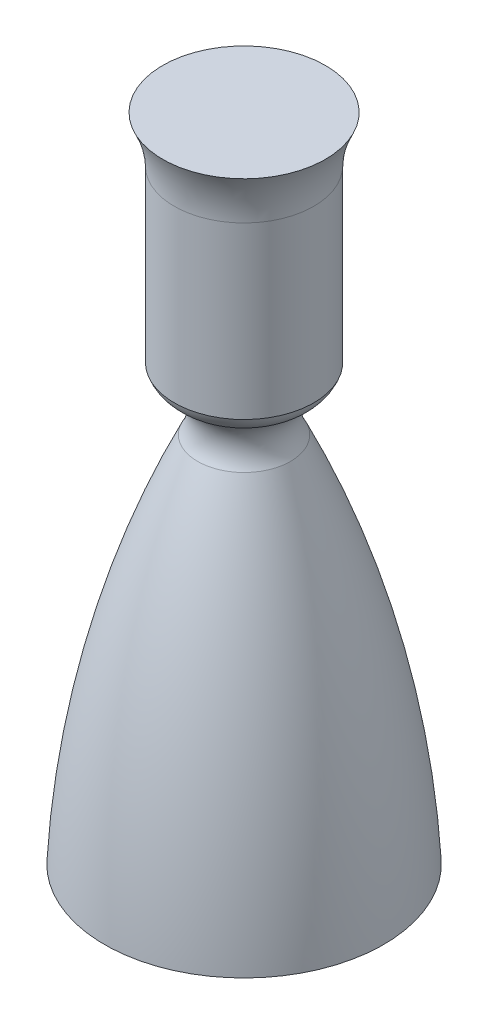
ISO-10303-21;
HEADER;
FILE_DESCRIPTION(('STEP AP214'),'2;1');
FILE_NAME('part.step','',(''),(''),'','','');
FILE_SCHEMA(('AUTOMOTIVE_DESIGN { 1 0 10303 214 1 1 1 1 }'));
ENDSEC;
DATA;
#1=APPLICATION_CONTEXT('core data for automotive mechanical design processes');
#2=APPLICATION_PROTOCOL_DEFINITION('international standard','automotive_design',2000,#1);
#3=PRODUCT_CONTEXT('',#1,'mechanical');
#4=PRODUCT('Part','Part','',(#3));
#5=PRODUCT_RELATED_PRODUCT_CATEGORY('part','',(#4));
#6=PRODUCT_DEFINITION_FORMATION('','',#4);
#7=PRODUCT_DEFINITION_CONTEXT('part definition',#1,'design');
#8=PRODUCT_DEFINITION('design','',#6,#7);
#9=PRODUCT_DEFINITION_SHAPE('','',#8);
#10=(LENGTH_UNIT() NAMED_UNIT(*) SI_UNIT(.MILLI.,.METRE.));
#11=(NAMED_UNIT(*) PLANE_ANGLE_UNIT() SI_UNIT($,.RADIAN.));
#12=(NAMED_UNIT(*) SI_UNIT($,.STERADIAN.) SOLID_ANGLE_UNIT());
#13=UNCERTAINTY_MEASURE_WITH_UNIT(LENGTH_MEASURE(1.E-05),#10,'distance_accuracy_value','');
#14=(GEOMETRIC_REPRESENTATION_CONTEXT(3) GLOBAL_UNCERTAINTY_ASSIGNED_CONTEXT((#13)) GLOBAL_UNIT_ASSIGNED_CONTEXT((#10,
#11,#12)) REPRESENTATION_CONTEXT('',''));
#15=CARTESIAN_POINT('',(0.,0.,0.));
#16=DIRECTION('',(0.,0.,1.));
#17=DIRECTION('',(1.,0.,0.));
#18=AXIS2_PLACEMENT_3D('',#15,#16,#17);
#19=CARTESIAN_POINT('',(0.,355.6,0.));
#20=DIRECTION('',(0.,1.,0.));
#21=DIRECTION('',(0.,0.,1.));
#22=AXIS2_PLACEMENT_3D('',#19,#20,#21);
#23=PLANE('',#22);
#24=CARTESIAN_POINT('',(0.,355.6,0.));
#25=DIRECTION('',(0.,-1.,0.));
#26=DIRECTION('',(0.,0.,-1.));
#27=AXIS2_PLACEMENT_3D('',#24,#25,#26);
#28=CIRCLE('',#27,44.45);
#29=CARTESIAN_POINT('',(0.,355.6,-44.45));
#30=VERTEX_POINT('',#29);
#31=EDGE_CURVE('E10',#30,#30,#28,.T.);
#32=ORIENTED_EDGE('',*,*,#31,.F.);
#33=EDGE_LOOP('',(#32));
#34=FACE_BOUND('',#33,.T.);
#35=ADVANCED_FACE('F35',(#34),#23,.T.);
#36=CARTESIAN_POINT('',(0.,329.370101053837,0.));
#37=DIRECTION('',(0.,-1.,0.));
#38=DIRECTION('',(0.,0.,-1.));
#39=AXIS2_PLACEMENT_3D('',#36,#37,#38);
#40=TOROIDAL_SURFACE('',#39,95.3945957846513,57.3006059164074);
#41=ORIENTED_EDGE('',*,*,#31,.T.);
#42=EDGE_LOOP('',(#41));
#43=FACE_BOUND('',#42,.T.);
#44=CARTESIAN_POINT('',(0.,330.2,0.));
#45=DIRECTION('',(0.,-1.,0.));
#46=DIRECTION('',(0.,0.,-1.));
#47=AXIS2_PLACEMENT_3D('',#44,#45,#46);
#48=CIRCLE('',#47,38.1);
#49=CARTESIAN_POINT('',(0.,330.2,-38.1));
#50=VERTEX_POINT('',#49);
#51=EDGE_CURVE('E41',#50,#50,#48,.T.);
#52=ORIENTED_EDGE('',*,*,#51,.F.);
#53=EDGE_LOOP('',(#52));
#54=FACE_BOUND('',#53,.T.);
#55=ADVANCED_FACE('F77',(#43,#54),#40,.F.);
#56=CARTESIAN_POINT('',(0.,0.,0.));
#57=DIRECTION('',(0.,-1.,0.));
#58=DIRECTION('',(0.,0.,-1.));
#59=AXIS2_PLACEMENT_3D('',#56,#57,#58);
#60=CYLINDRICAL_SURFACE('',#59,38.1);
#61=ORIENTED_EDGE('',*,*,#51,.T.);
#62=EDGE_LOOP('',(#61));
#63=FACE_BOUND('',#62,.T.);
#64=CARTESIAN_POINT('',(0.,237.221957416349,0.));
#65=DIRECTION('',(0.,-1.,0.));
#66=DIRECTION('',(0.,0.,-1.));
#67=AXIS2_PLACEMENT_3D('',#64,#65,#66);
#68=CIRCLE('',#67,38.1);
#69=CARTESIAN_POINT('',(0.,237.221957416349,-38.1));
#70=VERTEX_POINT('',#69);
#71=EDGE_CURVE('E45',#70,#70,#68,.T.);
#72=ORIENTED_EDGE('',*,*,#71,.F.);
#73=EDGE_LOOP('',(#72));
#74=FACE_BOUND('',#73,.T.);
#75=ADVANCED_FACE('F82',(#63,#74),#60,.T.);
#76=CARTESIAN_POINT('',(0.,243.372942252366,0.));
#77=DIRECTION('',(0.,-1.,0.));
#78=DIRECTION('',(0.,0.,-1.));
#79=AXIS2_PLACEMENT_3D('',#76,#77,#78);
#80=TOROIDAL_SURFACE('',#79,20.9845469494154,18.1871753601176);
#81=ORIENTED_EDGE('',*,*,#71,.T.);
#82=EDGE_LOOP('',(#81));
#83=FACE_BOUND('',#82,.T.);
#84=CARTESIAN_POINT('',(0.,226.652399009673,0.));
#85=DIRECTION('',(0.,-1.,0.));
#86=DIRECTION('',(0.,0.,-1.));
#87=AXIS2_PLACEMENT_3D('',#84,#85,#86);
#88=CIRCLE('',#87,28.1397395568098);
#89=CARTESIAN_POINT('',(0.,226.652399009673,-28.1397395568098));
#90=VERTEX_POINT('',#89);
#91=EDGE_CURVE('E49',#90,#90,#88,.T.);
#92=ORIENTED_EDGE('',*,*,#91,.F.);
#93=EDGE_LOOP('',(#92));
#94=FACE_BOUND('',#93,.T.);
#95=ADVANCED_FACE('F73',(#83,#94),#80,.T.);
#96=CARTESIAN_POINT('',(0.,213.277161795899,0.));
#97=DIRECTION('',(0.,-1.,0.));
#98=DIRECTION('',(0.,0.,-1.));
#99=AXIS2_PLACEMENT_3D('',#96,#97,#98);
#100=TOROIDAL_SURFACE('',#99,40.8857700419424,18.4758832983068);
#101=ORIENTED_EDGE('',*,*,#91,.T.);
#102=EDGE_LOOP('',(#101));
#103=FACE_BOUND('',#102,.T.);
#104=CARTESIAN_POINT('',(0.,203.2,0.));
#105=DIRECTION('',(0.,-1.,0.));
#106=DIRECTION('',(0.,0.,-1.));
#107=AXIS2_PLACEMENT_3D('',#104,#105,#106);
#108=CIRCLE('',#107,25.4);
#109=CARTESIAN_POINT('',(0.,203.2,-25.4));
#110=VERTEX_POINT('',#109);
#111=EDGE_CURVE('E54',#110,#110,#108,.T.);
#112=ORIENTED_EDGE('',*,*,#111,.F.);
#113=EDGE_LOOP('',(#112));
#114=FACE_BOUND('',#113,.T.);
#115=ADVANCED_FACE('F65',(#103,#114),#100,.F.);
#116=CARTESIAN_POINT('',(0.,-28.1693792700696,0.));
#117=DIRECTION('',(0.,-1.,0.));
#118=DIRECTION('',(0.,0.,-1.));
#119=AXIS2_PLACEMENT_3D('',#116,#117,#118);
#120=DEGENERATE_TOROIDAL_SURFACE('',#119,468.277517080278,545.205723130605,.F.);
#121=ORIENTED_EDGE('',*,*,#111,.T.);
#122=EDGE_LOOP('',(#121));
#123=FACE_BOUND('',#122,.T.);
#124=CARTESIAN_POINT('',(0.,0.,0.));
#125=DIRECTION('',(0.,-1.,0.));
#126=DIRECTION('',(0.,0.,-1.));
#127=AXIS2_PLACEMENT_3D('',#124,#125,#126);
#128=CIRCLE('',#127,76.2);
#129=CARTESIAN_POINT('',(0.,0.,-76.2));
#130=VERTEX_POINT('',#129);
#131=EDGE_CURVE('E57',#130,#130,#128,.T.);
#132=ORIENTED_EDGE('',*,*,#131,.F.);
#133=EDGE_LOOP('',(#132));
#134=FACE_BOUND('',#133,.T.);
#135=ADVANCED_FACE('F63',(#123,#134),#120,.F.);
#136=CARTESIAN_POINT('',(0.,0.,0.));
#137=DIRECTION('',(0.,-1.,0.));
#138=DIRECTION('',(0.,0.,-1.));
#139=AXIS2_PLACEMENT_3D('',#136,#137,#138);
#140=PLANE('',#139);
#141=ORIENTED_EDGE('',*,*,#131,.T.);
#142=EDGE_LOOP('',(#141));
#143=FACE_BOUND('',#142,.T.);
#144=ADVANCED_FACE('F61',(#143),#140,.T.);
#145=CLOSED_SHELL('',(#35,#55,#75,#95,#115,#135,#144));
#146=MANIFOLD_SOLID_BREP('B2',#145);
#147=ADVANCED_BREP_SHAPE_REPRESENTATION('',(#18,#146),#14);
#148=SHAPE_DEFINITION_REPRESENTATION(#9,#147);
ENDSEC;
END-ISO-10303-21;
